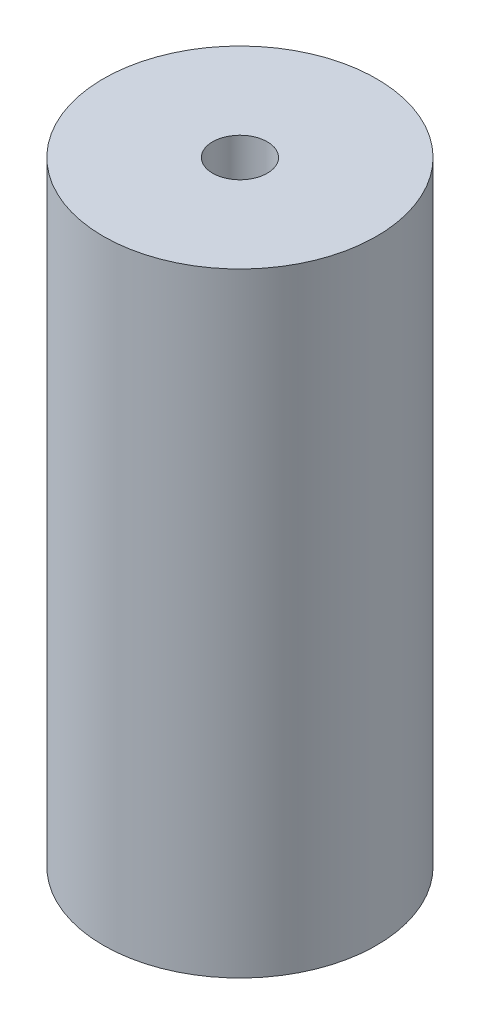
ISO-10303-21;
HEADER;
FILE_DESCRIPTION(('STEP AP214'),'2;1');
FILE_NAME('part.step','',(''),(''),'','','');
FILE_SCHEMA(('AUTOMOTIVE_DESIGN { 1 0 10303 214 1 1 1 1 }'));
ENDSEC;
DATA;
#1=APPLICATION_CONTEXT('core data for automotive mechanical design processes');
#2=APPLICATION_PROTOCOL_DEFINITION('international standard','automotive_design',2000,#1);
#3=PRODUCT_CONTEXT('',#1,'mechanical');
#4=PRODUCT('Part','Part','',(#3));
#5=PRODUCT_RELATED_PRODUCT_CATEGORY('part','',(#4));
#6=PRODUCT_DEFINITION_FORMATION('','',#4);
#7=PRODUCT_DEFINITION_CONTEXT('part definition',#1,'design');
#8=PRODUCT_DEFINITION('design','',#6,#7);
#9=PRODUCT_DEFINITION_SHAPE('','',#8);
#10=(LENGTH_UNIT() NAMED_UNIT(*) SI_UNIT(.MILLI.,.METRE.));
#11=(NAMED_UNIT(*) PLANE_ANGLE_UNIT() SI_UNIT($,.RADIAN.));
#12=(NAMED_UNIT(*) SI_UNIT($,.STERADIAN.) SOLID_ANGLE_UNIT());
#13=UNCERTAINTY_MEASURE_WITH_UNIT(LENGTH_MEASURE(1.E-05),#10,'distance_accuracy_value','');
#14=(GEOMETRIC_REPRESENTATION_CONTEXT(3) GLOBAL_UNCERTAINTY_ASSIGNED_CONTEXT((#13)) GLOBAL_UNIT_ASSIGNED_CONTEXT((#10,
#11,#12)) REPRESENTATION_CONTEXT('',''));
#15=CARTESIAN_POINT('',(0.,0.,0.));
#16=DIRECTION('',(0.,0.,1.));
#17=DIRECTION('',(1.,0.,0.));
#18=AXIS2_PLACEMENT_3D('',#15,#16,#17);
#19=CARTESIAN_POINT('',(0.,17.8435,0.));
#20=DIRECTION('',(0.,1.,0.));
#21=DIRECTION('',(0.,0.,1.));
#22=AXIS2_PLACEMENT_3D('',#19,#20,#21);
#23=PLANE('',#22);
#24=CARTESIAN_POINT('',(0.,17.8435,0.));
#25=DIRECTION('',(0.,1.,0.));
#26=DIRECTION('',(0.,0.,1.));
#27=AXIS2_PLACEMENT_3D('',#24,#25,#26);
#28=CIRCLE('',#27,7.9375);
#29=CARTESIAN_POINT('',(0.,17.8435,7.9375));
#30=VERTEX_POINT('',#29);
#31=EDGE_CURVE('E10',#30,#30,#28,.T.);
#32=ORIENTED_EDGE('',*,*,#31,.T.);
#33=EDGE_LOOP('',(#32));
#34=FACE_BOUND('',#33,.T.);
#35=CARTESIAN_POINT('',(0.,17.8435,0.));
#36=DIRECTION('',(0.,1.,0.));
#37=DIRECTION('',(0.,0.,1.));
#38=AXIS2_PLACEMENT_3D('',#35,#36,#37);
#39=CIRCLE('',#38,1.5875);
#40=CARTESIAN_POINT('',(0.,17.8435,1.5875));
#41=VERTEX_POINT('',#40);
#42=EDGE_CURVE('E42',#41,#41,#39,.T.);
#43=ORIENTED_EDGE('',*,*,#42,.F.);
#44=EDGE_LOOP('',(#43));
#45=FACE_BOUND('',#44,.T.);
#46=ADVANCED_FACE('F31',(#34,#45),#23,.T.);
#47=CARTESIAN_POINT('',(0.,-17.8435,0.));
#48=DIRECTION('',(0.,1.,0.));
#49=DIRECTION('',(0.,0.,1.));
#50=AXIS2_PLACEMENT_3D('',#47,#48,#49);
#51=PLANE('',#50);
#52=CARTESIAN_POINT('',(0.,-17.8435,0.));
#53=DIRECTION('',(0.,1.,0.));
#54=DIRECTION('',(0.,0.,1.));
#55=AXIS2_PLACEMENT_3D('',#52,#53,#54);
#56=CIRCLE('',#55,7.9375);
#57=CARTESIAN_POINT('',(0.,-17.8435,7.9375));
#58=VERTEX_POINT('',#57);
#59=EDGE_CURVE('E35',#58,#58,#56,.T.);
#60=ORIENTED_EDGE('',*,*,#59,.F.);
#61=EDGE_LOOP('',(#60));
#62=FACE_BOUND('',#61,.T.);
#63=CARTESIAN_POINT('',(0.,-17.8435,0.));
#64=DIRECTION('',(0.,1.,0.));
#65=DIRECTION('',(0.,0.,1.));
#66=AXIS2_PLACEMENT_3D('',#63,#64,#65);
#67=CIRCLE('',#66,1.5875);
#68=CARTESIAN_POINT('',(0.,-17.8435,1.5875));
#69=VERTEX_POINT('',#68);
#70=EDGE_CURVE('E44',#69,#69,#67,.T.);
#71=ORIENTED_EDGE('',*,*,#70,.T.);
#72=EDGE_LOOP('',(#71));
#73=FACE_BOUND('',#72,.T.);
#74=ADVANCED_FACE('F54',(#62,#73),#51,.F.);
#75=CARTESIAN_POINT('',(0.,17.8435,0.));
#76=DIRECTION('',(0.,-1.,0.));
#77=DIRECTION('',(0.,0.,-1.));
#78=AXIS2_PLACEMENT_3D('',#75,#76,#77);
#79=CYLINDRICAL_SURFACE('',#78,7.9375);
#80=ORIENTED_EDGE('',*,*,#31,.F.);
#81=EDGE_LOOP('',(#80));
#82=FACE_BOUND('',#81,.T.);
#83=ORIENTED_EDGE('',*,*,#59,.T.);
#84=EDGE_LOOP('',(#83));
#85=FACE_BOUND('',#84,.T.);
#86=ADVANCED_FACE('F33',(#82,#85),#79,.T.);
#87=CARTESIAN_POINT('',(0.,17.8435,0.));
#88=DIRECTION('',(0.,-1.,0.));
#89=DIRECTION('',(0.,0.,-1.));
#90=AXIS2_PLACEMENT_3D('',#87,#88,#89);
#91=CYLINDRICAL_SURFACE('',#90,1.5875);
#92=ORIENTED_EDGE('',*,*,#42,.T.);
#93=EDGE_LOOP('',(#92));
#94=FACE_BOUND('',#93,.T.);
#95=ORIENTED_EDGE('',*,*,#70,.F.);
#96=EDGE_LOOP('',(#95));
#97=FACE_BOUND('',#96,.T.);
#98=ADVANCED_FACE('F50',(#94,#97),#91,.F.);
#99=CLOSED_SHELL('',(#46,#74,#86,#98));
#100=MANIFOLD_SOLID_BREP('B2',#99);
#101=ADVANCED_BREP_SHAPE_REPRESENTATION('',(#18,#100),#14);
#102=SHAPE_DEFINITION_REPRESENTATION(#9,#101);
ENDSEC;
END-ISO-10303-21;
